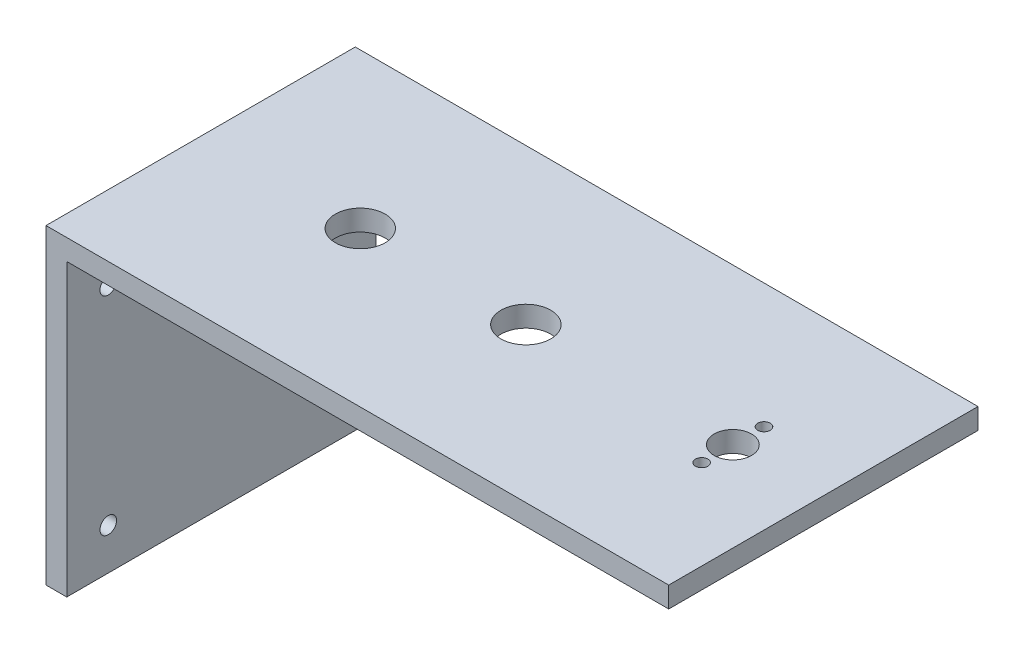
ISO-10303-21;
HEADER;
FILE_DESCRIPTION(('STEP AP214'),'2;1');
FILE_NAME('part.step','',(''),(''),'','','');
FILE_SCHEMA(('AUTOMOTIVE_DESIGN { 1 0 10303 214 1 1 1 1 }'));
ENDSEC;
DATA;
#1=APPLICATION_CONTEXT('core data for automotive mechanical design processes');
#2=APPLICATION_PROTOCOL_DEFINITION('international standard','automotive_design',2000,#1);
#3=PRODUCT_CONTEXT('',#1,'mechanical');
#4=PRODUCT('Part','Part','',(#3));
#5=PRODUCT_RELATED_PRODUCT_CATEGORY('part','',(#4));
#6=PRODUCT_DEFINITION_FORMATION('','',#4);
#7=PRODUCT_DEFINITION_CONTEXT('part definition',#1,'design');
#8=PRODUCT_DEFINITION('design','',#6,#7);
#9=PRODUCT_DEFINITION_SHAPE('','',#8);
#10=(LENGTH_UNIT() NAMED_UNIT(*) SI_UNIT(.MILLI.,.METRE.));
#11=(NAMED_UNIT(*) PLANE_ANGLE_UNIT() SI_UNIT($,.RADIAN.));
#12=(NAMED_UNIT(*) SI_UNIT($,.STERADIAN.) SOLID_ANGLE_UNIT());
#13=UNCERTAINTY_MEASURE_WITH_UNIT(LENGTH_MEASURE(1.E-05),#10,'distance_accuracy_value','');
#14=(GEOMETRIC_REPRESENTATION_CONTEXT(3) GLOBAL_UNCERTAINTY_ASSIGNED_CONTEXT((#13)) GLOBAL_UNIT_ASSIGNED_CONTEXT((#10,
#11,#12)) REPRESENTATION_CONTEXT('',''));
#15=CARTESIAN_POINT('',(0.,0.,0.));
#16=DIRECTION('',(0.,0.,1.));
#17=DIRECTION('',(1.,0.,0.));
#18=AXIS2_PLACEMENT_3D('',#15,#16,#17);
#19=CARTESIAN_POINT('',(-75.,5.,37.25));
#20=DIRECTION('',(1.,0.,0.));
#21=DIRECTION('',(0.,0.,-1.));
#22=AXIS2_PLACEMENT_3D('',#19,#20,#21);
#23=PLANE('',#22);
#24=CARTESIAN_POINT('',(-75.,-60.,27.25));
#25=DIRECTION('',(1.,0.,0.));
#26=DIRECTION('',(0.,0.,-1.));
#27=AXIS2_PLACEMENT_3D('',#24,#25,#26);
#28=CIRCLE('',#27,2.00000000000001);
#29=CARTESIAN_POINT('',(-75.,-60.,25.25));
#30=VERTEX_POINT('',#29);
#31=EDGE_CURVE('E122',#30,#30,#28,.T.);
#32=ORIENTED_EDGE('',*,*,#31,.T.);
#33=EDGE_LOOP('',(#32));
#34=FACE_BOUND('',#33,.T.);
#35=CARTESIAN_POINT('',(-75.,-60.,-27.25));
#36=DIRECTION('',(1.,0.,0.));
#37=DIRECTION('',(0.,0.,-1.));
#38=AXIS2_PLACEMENT_3D('',#35,#36,#37);
#39=CIRCLE('',#38,2.00000000000001);
#40=CARTESIAN_POINT('',(-75.,-60.,-29.25));
#41=VERTEX_POINT('',#40);
#42=EDGE_CURVE('E180',#41,#41,#39,.T.);
#43=ORIENTED_EDGE('',*,*,#42,.T.);
#44=EDGE_LOOP('',(#43));
#45=FACE_BOUND('',#44,.T.);
#46=CARTESIAN_POINT('',(-75.,-10.,-27.25));
#47=DIRECTION('',(1.,0.,0.));
#48=DIRECTION('',(0.,0.,-1.));
#49=AXIS2_PLACEMENT_3D('',#46,#47,#48);
#50=CIRCLE('',#49,2.);
#51=CARTESIAN_POINT('',(-75.,-10.,-29.25));
#52=VERTEX_POINT('',#51);
#53=EDGE_CURVE('E178',#52,#52,#50,.T.);
#54=ORIENTED_EDGE('',*,*,#53,.T.);
#55=EDGE_LOOP('',(#54));
#56=FACE_BOUND('',#55,.T.);
#57=CARTESIAN_POINT('',(-75.,-10.,27.25));
#58=DIRECTION('',(1.,0.,0.));
#59=DIRECTION('',(0.,0.,-1.));
#60=AXIS2_PLACEMENT_3D('',#57,#58,#59);
#61=CIRCLE('',#60,2.);
#62=CARTESIAN_POINT('',(-75.,-10.,25.25));
#63=VERTEX_POINT('',#62);
#64=EDGE_CURVE('E175',#63,#63,#61,.T.);
#65=ORIENTED_EDGE('',*,*,#64,.T.);
#66=EDGE_LOOP('',(#65));
#67=FACE_BOUND('',#66,.T.);
#68=DIRECTION('',(0.,-1.,0.));
#69=VECTOR('',#68,1.);
#70=CARTESIAN_POINT('',(-75.,5.,-37.25));
#71=LINE('',#70,#69);
#72=CARTESIAN_POINT('',(-75.,5.,-37.25));
#73=VERTEX_POINT('',#72);
#74=CARTESIAN_POINT('',(-75.,-70.,-37.25));
#75=VERTEX_POINT('',#74);
#76=EDGE_CURVE('E99',#73,#75,#71,.T.);
#77=ORIENTED_EDGE('',*,*,#76,.T.);
#78=DIRECTION('',(0.,0.,-1.));
#79=VECTOR('',#78,1.);
#80=CARTESIAN_POINT('',(-75.,-70.,-37.25));
#81=LINE('',#80,#79);
#82=CARTESIAN_POINT('',(-75.,-70.,37.25));
#83=VERTEX_POINT('',#82);
#84=EDGE_CURVE('E103',#83,#75,#81,.T.);
#85=ORIENTED_EDGE('',*,*,#84,.F.);
#86=DIRECTION('',(0.,-1.,0.));
#87=VECTOR('',#86,1.);
#88=CARTESIAN_POINT('',(-75.,5.,37.25));
#89=LINE('',#88,#87);
#90=CARTESIAN_POINT('',(-75.,5.,37.25));
#91=VERTEX_POINT('',#90);
#92=EDGE_CURVE('E11',#91,#83,#89,.T.);
#93=ORIENTED_EDGE('',*,*,#92,.F.);
#94=DIRECTION('',(0.,0.,1.));
#95=VECTOR('',#94,1.);
#96=CARTESIAN_POINT('',(-75.,5.,37.25));
#97=LINE('',#96,#95);
#98=EDGE_CURVE('E104',#73,#91,#97,.T.);
#99=ORIENTED_EDGE('',*,*,#98,.F.);
#100=EDGE_LOOP('',(#77,#85,#93,#99));
#101=FACE_BOUND('',#100,.T.);
#102=ADVANCED_FACE('F35',(#34,#45,#56,#67,#101),#23,.F.);
#103=CARTESIAN_POINT('',(-75.,5.,37.25));
#104=DIRECTION('',(0.,0.,-1.));
#105=DIRECTION('',(-1.,0.,0.));
#106=AXIS2_PLACEMENT_3D('',#103,#104,#105);
#107=PLANE('',#106);
#108=ORIENTED_EDGE('',*,*,#92,.T.);
#109=DIRECTION('',(-1.,0.,0.));
#110=VECTOR('',#109,1.);
#111=CARTESIAN_POINT('',(-75.,-70.,37.25));
#112=LINE('',#111,#110);
#113=CARTESIAN_POINT('',(-70.,-70.,37.25));
#114=VERTEX_POINT('',#113);
#115=EDGE_CURVE('E120',#114,#83,#112,.T.);
#116=ORIENTED_EDGE('',*,*,#115,.F.);
#117=DIRECTION('',(0.,1.,0.));
#118=VECTOR('',#117,1.);
#119=CARTESIAN_POINT('',(-70.,-70.,37.25));
#120=LINE('',#119,#118);
#121=CARTESIAN_POINT('',(-70.,0.,37.25));
#122=VERTEX_POINT('',#121);
#123=EDGE_CURVE('E128',#114,#122,#120,.T.);
#124=ORIENTED_EDGE('',*,*,#123,.T.);
#125=DIRECTION('',(1.,0.,0.));
#126=VECTOR('',#125,1.);
#127=CARTESIAN_POINT('',(-75.,0.,37.25));
#128=LINE('',#127,#126);
#129=CARTESIAN_POINT('',(75.,0.,37.25));
#130=VERTEX_POINT('',#129);
#131=EDGE_CURVE('E133',#122,#130,#128,.T.);
#132=ORIENTED_EDGE('',*,*,#131,.T.);
#133=DIRECTION('',(0.,-1.,0.));
#134=VECTOR('',#133,1.);
#135=CARTESIAN_POINT('',(75.,5.,37.25));
#136=LINE('',#135,#134);
#137=CARTESIAN_POINT('',(75.,5.,37.25));
#138=VERTEX_POINT('',#137);
#139=EDGE_CURVE('E43',#138,#130,#136,.T.);
#140=ORIENTED_EDGE('',*,*,#139,.F.);
#141=DIRECTION('',(1.,0.,0.));
#142=VECTOR('',#141,1.);
#143=CARTESIAN_POINT('',(-75.,5.,37.25));
#144=LINE('',#143,#142);
#145=EDGE_CURVE('E83',#91,#138,#144,.T.);
#146=ORIENTED_EDGE('',*,*,#145,.F.);
#147=EDGE_LOOP('',(#108,#116,#124,#132,#140,#146));
#148=FACE_BOUND('',#147,.T.);
#149=ADVANCED_FACE('F205',(#148),#107,.F.);
#150=CARTESIAN_POINT('',(75.,5.,37.25));
#151=DIRECTION('',(-1.,0.,0.));
#152=DIRECTION('',(0.,0.,1.));
#153=AXIS2_PLACEMENT_3D('',#150,#151,#152);
#154=PLANE('',#153);
#155=DIRECTION('',(0.,0.,-1.));
#156=VECTOR('',#155,1.);
#157=CARTESIAN_POINT('',(75.,0.,37.25));
#158=LINE('',#157,#156);
#159=CARTESIAN_POINT('',(75.,0.,-37.25));
#160=VERTEX_POINT('',#159);
#161=EDGE_CURVE('E76',#130,#160,#158,.T.);
#162=ORIENTED_EDGE('',*,*,#161,.T.);
#163=DIRECTION('',(0.,-1.,0.));
#164=VECTOR('',#163,1.);
#165=CARTESIAN_POINT('',(75.,5.,-37.25));
#166=LINE('',#165,#164);
#167=CARTESIAN_POINT('',(75.,5.,-37.25));
#168=VERTEX_POINT('',#167);
#169=EDGE_CURVE('E106',#168,#160,#166,.T.);
#170=ORIENTED_EDGE('',*,*,#169,.F.);
#171=DIRECTION('',(0.,0.,-1.));
#172=VECTOR('',#171,1.);
#173=CARTESIAN_POINT('',(75.,5.,37.25));
#174=LINE('',#173,#172);
#175=EDGE_CURVE('E137',#138,#168,#174,.T.);
#176=ORIENTED_EDGE('',*,*,#175,.F.);
#177=ORIENTED_EDGE('',*,*,#139,.T.);
#178=EDGE_LOOP('',(#162,#170,#176,#177));
#179=FACE_BOUND('',#178,.T.);
#180=ADVANCED_FACE('F209',(#179),#154,.F.);
#181=CARTESIAN_POINT('',(-75.,5.,-37.25));
#182=DIRECTION('',(0.,0.,1.));
#183=DIRECTION('',(1.,0.,0.));
#184=AXIS2_PLACEMENT_3D('',#181,#182,#183);
#185=PLANE('',#184);
#186=DIRECTION('',(-1.,0.,0.));
#187=VECTOR('',#186,1.);
#188=CARTESIAN_POINT('',(-75.,0.,-37.25));
#189=LINE('',#188,#187);
#190=CARTESIAN_POINT('',(-70.,0.,-37.25));
#191=VERTEX_POINT('',#190);
#192=EDGE_CURVE('E135',#160,#191,#189,.T.);
#193=ORIENTED_EDGE('',*,*,#192,.T.);
#194=DIRECTION('',(0.,1.,0.));
#195=VECTOR('',#194,1.);
#196=CARTESIAN_POINT('',(-70.,-70.,-37.25));
#197=LINE('',#196,#195);
#198=CARTESIAN_POINT('',(-70.,-70.,-37.25));
#199=VERTEX_POINT('',#198);
#200=EDGE_CURVE('E112',#199,#191,#197,.T.);
#201=ORIENTED_EDGE('',*,*,#200,.F.);
#202=DIRECTION('',(1.,0.,0.));
#203=VECTOR('',#202,1.);
#204=CARTESIAN_POINT('',(-70.,-70.,-37.25));
#205=LINE('',#204,#203);
#206=EDGE_CURVE('E109',#75,#199,#205,.T.);
#207=ORIENTED_EDGE('',*,*,#206,.F.);
#208=ORIENTED_EDGE('',*,*,#76,.F.);
#209=DIRECTION('',(-1.,0.,0.));
#210=VECTOR('',#209,1.);
#211=CARTESIAN_POINT('',(-75.,5.,-37.25));
#212=LINE('',#211,#210);
#213=EDGE_CURVE('E60',#168,#73,#212,.T.);
#214=ORIENTED_EDGE('',*,*,#213,.F.);
#215=ORIENTED_EDGE('',*,*,#169,.T.);
#216=EDGE_LOOP('',(#193,#201,#207,#208,#214,#215));
#217=FACE_BOUND('',#216,.T.);
#218=ADVANCED_FACE('F110',(#217),#185,.F.);
#219=CARTESIAN_POINT('',(0.,5.,0.));
#220=DIRECTION('',(0.,-1.,0.));
#221=DIRECTION('',(0.,0.,-1.));
#222=AXIS2_PLACEMENT_3D('',#219,#220,#221);
#223=PLANE('',#222);
#224=CARTESIAN_POINT('',(-36.55,5.,0.));
#225=DIRECTION('',(0.,1.,0.));
#226=DIRECTION('',(0.,0.,1.));
#227=AXIS2_PLACEMENT_3D('',#224,#225,#226);
#228=CIRCLE('',#227,6.);
#229=CARTESIAN_POINT('',(-36.55,5.,6.));
#230=VERTEX_POINT('',#229);
#231=EDGE_CURVE('E149',#230,#230,#228,.T.);
#232=ORIENTED_EDGE('',*,*,#231,.F.);
#233=EDGE_LOOP('',(#232));
#234=FACE_BOUND('',#233,.T.);
#235=CARTESIAN_POINT('',(53.4291667470417,5.,7.74997106498227));
#236=DIRECTION('',(0.,1.,0.));
#237=DIRECTION('',(0.,0.,-1.));
#238=AXIS2_PLACEMENT_3D('',#235,#236,#237);
#239=CIRCLE('',#238,1.5);
#240=CARTESIAN_POINT('',(53.4291667470417,5.,6.24997106498227));
#241=VERTEX_POINT('',#240);
#242=EDGE_CURVE('E277',#241,#241,#239,.T.);
#243=ORIENTED_EDGE('',*,*,#242,.F.);
#244=EDGE_LOOP('',(#243));
#245=FACE_BOUND('',#244,.T.);
#246=CARTESIAN_POINT('',(53.45,5.,-7.24999999999999));
#247=DIRECTION('',(0.,1.,0.));
#248=DIRECTION('',(0.,0.,1.));
#249=AXIS2_PLACEMENT_3D('',#246,#247,#248);
#250=CIRCLE('',#249,1.5);
#251=CARTESIAN_POINT('',(53.45,5.,-5.74999999999999));
#252=VERTEX_POINT('',#251);
#253=EDGE_CURVE('E274',#252,#252,#250,.T.);
#254=ORIENTED_EDGE('',*,*,#253,.F.);
#255=EDGE_LOOP('',(#254));
#256=FACE_BOUND('',#255,.T.);
#257=CARTESIAN_POINT('',(53.45,5.,0.250000000000007));
#258=DIRECTION('',(0.,1.,0.));
#259=DIRECTION('',(0.,0.,1.));
#260=AXIS2_PLACEMENT_3D('',#257,#258,#259);
#261=CIRCLE('',#260,4.5);
#262=CARTESIAN_POINT('',(53.45,5.,4.75000000000001));
#263=VERTEX_POINT('',#262);
#264=EDGE_CURVE('E271',#263,#263,#261,.T.);
#265=ORIENTED_EDGE('',*,*,#264,.F.);
#266=EDGE_LOOP('',(#265));
#267=FACE_BOUND('',#266,.T.);
#268=CARTESIAN_POINT('',(3.44984567990542,5.,0.111110682444187));
#269=DIRECTION('',(0.,1.,0.));
#270=DIRECTION('',(0.,0.,1.));
#271=AXIS2_PLACEMENT_3D('',#268,#269,#270);
#272=CIRCLE('',#271,6.);
#273=CARTESIAN_POINT('',(3.44984567990542,5.,6.11111068244419));
#274=VERTEX_POINT('',#273);
#275=EDGE_CURVE('E268',#274,#274,#272,.T.);
#276=ORIENTED_EDGE('',*,*,#275,.F.);
#277=EDGE_LOOP('',(#276));
#278=FACE_BOUND('',#277,.T.);
#279=ORIENTED_EDGE('',*,*,#98,.T.);
#280=ORIENTED_EDGE('',*,*,#145,.T.);
#281=ORIENTED_EDGE('',*,*,#175,.T.);
#282=ORIENTED_EDGE('',*,*,#213,.T.);
#283=EDGE_LOOP('',(#279,#280,#281,#282));
#284=FACE_BOUND('',#283,.T.);
#285=ADVANCED_FACE('F217',(#234,#245,#256,#267,#278,#284),#223,.F.);
#286=CARTESIAN_POINT('',(0.,0.,0.));
#287=DIRECTION('',(0.,-1.,0.));
#288=DIRECTION('',(0.,0.,-1.));
#289=AXIS2_PLACEMENT_3D('',#286,#287,#288);
#290=PLANE('',#289);
#291=CARTESIAN_POINT('',(-36.55,0.,0.));
#292=DIRECTION('',(0.,-1.,0.));
#293=DIRECTION('',(0.,0.,-1.));
#294=AXIS2_PLACEMENT_3D('',#291,#292,#293);
#295=CIRCLE('',#294,6.);
#296=CARTESIAN_POINT('',(-36.55,0.,-6.));
#297=VERTEX_POINT('',#296);
#298=EDGE_CURVE('E38',#297,#297,#295,.T.);
#299=ORIENTED_EDGE('',*,*,#298,.F.);
#300=EDGE_LOOP('',(#299));
#301=FACE_BOUND('',#300,.T.);
#302=CARTESIAN_POINT('',(53.4291667470417,0.,7.74997106498227));
#303=DIRECTION('',(0.,-1.,0.));
#304=DIRECTION('',(0.,0.,-1.));
#305=AXIS2_PLACEMENT_3D('',#302,#303,#304);
#306=CIRCLE('',#305,1.5);
#307=CARTESIAN_POINT('',(53.4291667470417,0.,6.24997106498227));
#308=VERTEX_POINT('',#307);
#309=EDGE_CURVE('E154',#308,#308,#306,.T.);
#310=ORIENTED_EDGE('',*,*,#309,.F.);
#311=EDGE_LOOP('',(#310));
#312=FACE_BOUND('',#311,.T.);
#313=CARTESIAN_POINT('',(53.45,0.,-7.24999999999999));
#314=DIRECTION('',(0.,-1.,0.));
#315=DIRECTION('',(0.,0.,-1.));
#316=AXIS2_PLACEMENT_3D('',#313,#314,#315);
#317=CIRCLE('',#316,1.5);
#318=CARTESIAN_POINT('',(53.45,0.,-8.75));
#319=VERTEX_POINT('',#318);
#320=EDGE_CURVE('E152',#319,#319,#317,.T.);
#321=ORIENTED_EDGE('',*,*,#320,.F.);
#322=EDGE_LOOP('',(#321));
#323=FACE_BOUND('',#322,.T.);
#324=CARTESIAN_POINT('',(53.45,0.,0.250000000000007));
#325=DIRECTION('',(0.,-1.,0.));
#326=DIRECTION('',(0.,0.,-1.));
#327=AXIS2_PLACEMENT_3D('',#324,#325,#326);
#328=CIRCLE('',#327,4.5);
#329=CARTESIAN_POINT('',(53.45,0.,-4.24999999999999));
#330=VERTEX_POINT('',#329);
#331=EDGE_CURVE('E148',#330,#330,#328,.T.);
#332=ORIENTED_EDGE('',*,*,#331,.F.);
#333=EDGE_LOOP('',(#332));
#334=FACE_BOUND('',#333,.T.);
#335=CARTESIAN_POINT('',(3.44984567990542,0.,0.111110682444187));
#336=DIRECTION('',(0.,-1.,0.));
#337=DIRECTION('',(0.,0.,-1.));
#338=AXIS2_PLACEMENT_3D('',#335,#336,#337);
#339=CIRCLE('',#338,6.);
#340=CARTESIAN_POINT('',(3.44984567990542,0.,-5.88888931755582));
#341=VERTEX_POINT('',#340);
#342=EDGE_CURVE('E145',#341,#341,#339,.T.);
#343=ORIENTED_EDGE('',*,*,#342,.F.);
#344=EDGE_LOOP('',(#343));
#345=FACE_BOUND('',#344,.T.);
#346=DIRECTION('',(0.,0.,1.));
#347=VECTOR('',#346,1.);
#348=CARTESIAN_POINT('',(-70.,0.,37.25));
#349=LINE('',#348,#347);
#350=EDGE_CURVE('E51',#191,#122,#349,.T.);
#351=ORIENTED_EDGE('',*,*,#350,.F.);
#352=ORIENTED_EDGE('',*,*,#192,.F.);
#353=ORIENTED_EDGE('',*,*,#161,.F.);
#354=ORIENTED_EDGE('',*,*,#131,.F.);
#355=EDGE_LOOP('',(#351,#352,#353,#354));
#356=FACE_BOUND('',#355,.T.);
#357=ADVANCED_FACE('F218',(#301,#312,#323,#334,#345,#356),#290,.T.);
#358=CARTESIAN_POINT('',(-70.,-70.,37.25));
#359=DIRECTION('',(-1.,0.,0.));
#360=DIRECTION('',(0.,0.,1.));
#361=AXIS2_PLACEMENT_3D('',#358,#359,#360);
#362=PLANE('',#361);
#363=CARTESIAN_POINT('',(-70.,-60.,27.25));
#364=DIRECTION('',(1.,0.,0.));
#365=DIRECTION('',(0.,0.,1.));
#366=AXIS2_PLACEMENT_3D('',#363,#364,#365);
#367=CIRCLE('',#366,2.00000000000001);
#368=CARTESIAN_POINT('',(-70.,-60.,29.25));
#369=VERTEX_POINT('',#368);
#370=EDGE_CURVE('E159',#369,#369,#367,.T.);
#371=ORIENTED_EDGE('',*,*,#370,.F.);
#372=EDGE_LOOP('',(#371));
#373=FACE_BOUND('',#372,.T.);
#374=CARTESIAN_POINT('',(-70.,-60.,-27.25));
#375=DIRECTION('',(1.,0.,0.));
#376=DIRECTION('',(0.,0.,1.));
#377=AXIS2_PLACEMENT_3D('',#374,#375,#376);
#378=CIRCLE('',#377,2.00000000000001);
#379=CARTESIAN_POINT('',(-70.,-60.,-25.25));
#380=VERTEX_POINT('',#379);
#381=EDGE_CURVE('E163',#380,#380,#378,.T.);
#382=ORIENTED_EDGE('',*,*,#381,.F.);
#383=EDGE_LOOP('',(#382));
#384=FACE_BOUND('',#383,.T.);
#385=CARTESIAN_POINT('',(-70.,-10.,-27.25));
#386=DIRECTION('',(1.,0.,0.));
#387=DIRECTION('',(0.,0.,-1.));
#388=AXIS2_PLACEMENT_3D('',#385,#386,#387);
#389=CIRCLE('',#388,2.);
#390=CARTESIAN_POINT('',(-70.,-10.,-29.25));
#391=VERTEX_POINT('',#390);
#392=EDGE_CURVE('E168',#391,#391,#389,.T.);
#393=ORIENTED_EDGE('',*,*,#392,.F.);
#394=EDGE_LOOP('',(#393));
#395=FACE_BOUND('',#394,.T.);
#396=CARTESIAN_POINT('',(-70.,-10.,27.25));
#397=DIRECTION('',(1.,0.,0.));
#398=DIRECTION('',(0.,0.,-1.));
#399=AXIS2_PLACEMENT_3D('',#396,#397,#398);
#400=CIRCLE('',#399,2.);
#401=CARTESIAN_POINT('',(-70.,-10.,25.25));
#402=VERTEX_POINT('',#401);
#403=EDGE_CURVE('E172',#402,#402,#400,.T.);
#404=ORIENTED_EDGE('',*,*,#403,.F.);
#405=EDGE_LOOP('',(#404));
#406=FACE_BOUND('',#405,.T.);
#407=ORIENTED_EDGE('',*,*,#350,.T.);
#408=ORIENTED_EDGE('',*,*,#123,.F.);
#409=DIRECTION('',(0.,0.,1.));
#410=VECTOR('',#409,1.);
#411=CARTESIAN_POINT('',(-70.,-70.,37.25));
#412=LINE('',#411,#410);
#413=EDGE_CURVE('E115',#199,#114,#412,.T.);
#414=ORIENTED_EDGE('',*,*,#413,.F.);
#415=ORIENTED_EDGE('',*,*,#200,.T.);
#416=EDGE_LOOP('',(#407,#408,#414,#415));
#417=FACE_BOUND('',#416,.T.);
#418=ADVANCED_FACE('F221',(#373,#384,#395,#406,#417),#362,.F.);
#419=CARTESIAN_POINT('',(0.,-70.,0.));
#420=DIRECTION('',(0.,1.,0.));
#421=DIRECTION('',(0.,0.,1.));
#422=AXIS2_PLACEMENT_3D('',#419,#420,#421);
#423=PLANE('',#422);
#424=ORIENTED_EDGE('',*,*,#84,.T.);
#425=ORIENTED_EDGE('',*,*,#206,.T.);
#426=ORIENTED_EDGE('',*,*,#413,.T.);
#427=ORIENTED_EDGE('',*,*,#115,.T.);
#428=EDGE_LOOP('',(#424,#425,#426,#427));
#429=FACE_BOUND('',#428,.T.);
#430=ADVANCED_FACE('F118',(#429),#423,.F.);
#431=CARTESIAN_POINT('',(-140.,-10.,27.25));
#432=DIRECTION('',(1.,0.,0.));
#433=DIRECTION('',(0.,0.,-1.));
#434=AXIS2_PLACEMENT_3D('',#431,#432,#433);
#435=CYLINDRICAL_SURFACE('',#434,2.);
#436=ORIENTED_EDGE('',*,*,#403,.T.);
#437=EDGE_LOOP('',(#436));
#438=FACE_BOUND('',#437,.T.);
#439=ORIENTED_EDGE('',*,*,#64,.F.);
#440=EDGE_LOOP('',(#439));
#441=FACE_BOUND('',#440,.T.);
#442=ADVANCED_FACE('F230',(#438,#441),#435,.F.);
#443=CARTESIAN_POINT('',(-140.,-10.,-27.25));
#444=DIRECTION('',(1.,0.,0.));
#445=DIRECTION('',(0.,0.,-1.));
#446=AXIS2_PLACEMENT_3D('',#443,#444,#445);
#447=CYLINDRICAL_SURFACE('',#446,2.);
#448=ORIENTED_EDGE('',*,*,#392,.T.);
#449=EDGE_LOOP('',(#448));
#450=FACE_BOUND('',#449,.T.);
#451=ORIENTED_EDGE('',*,*,#53,.F.);
#452=EDGE_LOOP('',(#451));
#453=FACE_BOUND('',#452,.T.);
#454=ADVANCED_FACE('F200',(#450,#453),#447,.F.);
#455=CARTESIAN_POINT('',(-140.,-60.,-27.25));
#456=DIRECTION('',(1.,0.,0.));
#457=DIRECTION('',(0.,0.,-1.));
#458=AXIS2_PLACEMENT_3D('',#455,#456,#457);
#459=CYLINDRICAL_SURFACE('',#458,2.00000000000001);
#460=ORIENTED_EDGE('',*,*,#381,.T.);
#461=EDGE_LOOP('',(#460));
#462=FACE_BOUND('',#461,.T.);
#463=ORIENTED_EDGE('',*,*,#42,.F.);
#464=EDGE_LOOP('',(#463));
#465=FACE_BOUND('',#464,.T.);
#466=ADVANCED_FACE('F191',(#462,#465),#459,.F.);
#467=CARTESIAN_POINT('',(-140.,-60.,27.25));
#468=DIRECTION('',(1.,0.,0.));
#469=DIRECTION('',(0.,0.,-1.));
#470=AXIS2_PLACEMENT_3D('',#467,#468,#469);
#471=CYLINDRICAL_SURFACE('',#470,2.00000000000001);
#472=ORIENTED_EDGE('',*,*,#370,.T.);
#473=EDGE_LOOP('',(#472));
#474=FACE_BOUND('',#473,.T.);
#475=ORIENTED_EDGE('',*,*,#31,.F.);
#476=EDGE_LOOP('',(#475));
#477=FACE_BOUND('',#476,.T.);
#478=ADVANCED_FACE('F188',(#474,#477),#471,.F.);
#479=CARTESIAN_POINT('',(3.44984567990542,-65.,0.111110682444187));
#480=DIRECTION('',(0.,1.,0.));
#481=DIRECTION('',(0.,0.,1.));
#482=AXIS2_PLACEMENT_3D('',#479,#480,#481);
#483=CYLINDRICAL_SURFACE('',#482,6.);
#484=ORIENTED_EDGE('',*,*,#342,.T.);
#485=EDGE_LOOP('',(#484));
#486=FACE_BOUND('',#485,.T.);
#487=ORIENTED_EDGE('',*,*,#275,.T.);
#488=EDGE_LOOP('',(#487));
#489=FACE_BOUND('',#488,.T.);
#490=ADVANCED_FACE('F190',(#486,#489),#483,.F.);
#491=CARTESIAN_POINT('',(53.45,-65.,0.250000000000007));
#492=DIRECTION('',(0.,1.,0.));
#493=DIRECTION('',(0.,0.,1.));
#494=AXIS2_PLACEMENT_3D('',#491,#492,#493);
#495=CYLINDRICAL_SURFACE('',#494,4.5);
#496=ORIENTED_EDGE('',*,*,#331,.T.);
#497=EDGE_LOOP('',(#496));
#498=FACE_BOUND('',#497,.T.);
#499=ORIENTED_EDGE('',*,*,#264,.T.);
#500=EDGE_LOOP('',(#499));
#501=FACE_BOUND('',#500,.T.);
#502=ADVANCED_FACE('F197',(#498,#501),#495,.F.);
#503=CARTESIAN_POINT('',(53.45,-65.,-7.24999999999999));
#504=DIRECTION('',(0.,1.,0.));
#505=DIRECTION('',(0.,0.,1.));
#506=AXIS2_PLACEMENT_3D('',#503,#504,#505);
#507=CYLINDRICAL_SURFACE('',#506,1.5);
#508=ORIENTED_EDGE('',*,*,#320,.T.);
#509=EDGE_LOOP('',(#508));
#510=FACE_BOUND('',#509,.T.);
#511=ORIENTED_EDGE('',*,*,#253,.T.);
#512=EDGE_LOOP('',(#511));
#513=FACE_BOUND('',#512,.T.);
#514=ADVANCED_FACE('F252',(#510,#513),#507,.F.);
#515=CARTESIAN_POINT('',(53.4291667470417,-65.,7.74997106498227));
#516=DIRECTION('',(0.,1.,0.));
#517=DIRECTION('',(0.,0.,1.));
#518=AXIS2_PLACEMENT_3D('',#515,#516,#517);
#519=CYLINDRICAL_SURFACE('',#518,1.5);
#520=ORIENTED_EDGE('',*,*,#309,.T.);
#521=EDGE_LOOP('',(#520));
#522=FACE_BOUND('',#521,.T.);
#523=ORIENTED_EDGE('',*,*,#242,.T.);
#524=EDGE_LOOP('',(#523));
#525=FACE_BOUND('',#524,.T.);
#526=ADVANCED_FACE('F255',(#522,#525),#519,.F.);
#527=CARTESIAN_POINT('',(-36.55,-65.,0.));
#528=DIRECTION('',(0.,1.,0.));
#529=DIRECTION('',(0.,0.,1.));
#530=AXIS2_PLACEMENT_3D('',#527,#528,#529);
#531=CYLINDRICAL_SURFACE('',#530,6.);
#532=ORIENTED_EDGE('',*,*,#298,.T.);
#533=EDGE_LOOP('',(#532));
#534=FACE_BOUND('',#533,.T.);
#535=ORIENTED_EDGE('',*,*,#231,.T.);
#536=EDGE_LOOP('',(#535));
#537=FACE_BOUND('',#536,.T.);
#538=ADVANCED_FACE('F258',(#534,#537),#531,.F.);
#539=CLOSED_SHELL('',(#102,#149,#180,#218,#285,#357,#418,#430,#442,#454,#466,#478,#490,#502,
#514,#526,#538));
#540=MANIFOLD_SOLID_BREP('B2',#539);
#541=ADVANCED_BREP_SHAPE_REPRESENTATION('',(#18,#540),#14);
#542=SHAPE_DEFINITION_REPRESENTATION(#9,#541);
ENDSEC;
END-ISO-10303-21;
